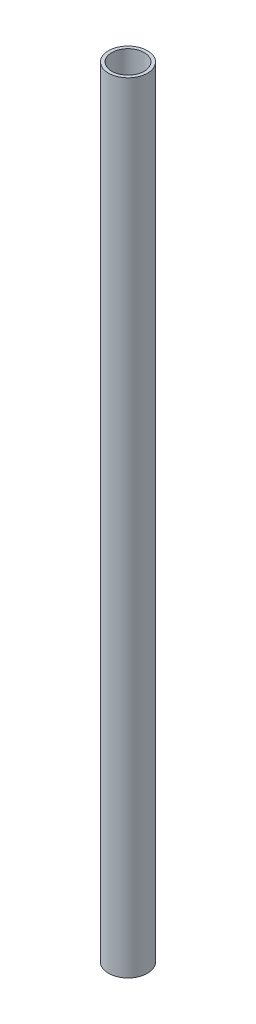
ISO-10303-21;
HEADER;
FILE_DESCRIPTION(('STEP AP214'),'2;1');
FILE_NAME('part.step','',(''),(''),'','','');
FILE_SCHEMA(('AUTOMOTIVE_DESIGN { 1 0 10303 214 1 1 1 1 }'));
ENDSEC;
DATA;
#1=APPLICATION_CONTEXT('core data for automotive mechanical design processes');
#2=APPLICATION_PROTOCOL_DEFINITION('international standard','automotive_design',2000,#1);
#3=PRODUCT_CONTEXT('',#1,'mechanical');
#4=PRODUCT('Part','Part','',(#3));
#5=PRODUCT_RELATED_PRODUCT_CATEGORY('part','',(#4));
#6=PRODUCT_DEFINITION_FORMATION('','',#4);
#7=PRODUCT_DEFINITION_CONTEXT('part definition',#1,'design');
#8=PRODUCT_DEFINITION('design','',#6,#7);
#9=PRODUCT_DEFINITION_SHAPE('','',#8);
#10=(LENGTH_UNIT() NAMED_UNIT(*) SI_UNIT(.MILLI.,.METRE.));
#11=(NAMED_UNIT(*) PLANE_ANGLE_UNIT() SI_UNIT($,.RADIAN.));
#12=(NAMED_UNIT(*) SI_UNIT($,.STERADIAN.) SOLID_ANGLE_UNIT());
#13=UNCERTAINTY_MEASURE_WITH_UNIT(LENGTH_MEASURE(1.E-05),#10,'distance_accuracy_value','');
#14=(GEOMETRIC_REPRESENTATION_CONTEXT(3) GLOBAL_UNCERTAINTY_ASSIGNED_CONTEXT((#13)) GLOBAL_UNIT_ASSIGNED_CONTEXT((#10,
#11,#12)) REPRESENTATION_CONTEXT('',''));
#15=CARTESIAN_POINT('',(0.,0.,0.));
#16=DIRECTION('',(0.,0.,1.));
#17=DIRECTION('',(1.,0.,0.));
#18=AXIS2_PLACEMENT_3D('',#15,#16,#17);
#19=CARTESIAN_POINT('',(0.,609.6,0.));
#20=DIRECTION('',(0.,1.,0.));
#21=DIRECTION('',(0.,0.,1.));
#22=AXIS2_PLACEMENT_3D('',#19,#20,#21);
#23=PLANE('',#22);
#24=CARTESIAN_POINT('',(0.,609.6,0.));
#25=DIRECTION('',(0.,1.,0.));
#26=DIRECTION('',(0.,0.,1.));
#27=AXIS2_PLACEMENT_3D('',#24,#25,#26);
#28=CIRCLE('',#27,30.48);
#29=CARTESIAN_POINT('',(0.,609.6,30.48));
#30=VERTEX_POINT('',#29);
#31=EDGE_CURVE('E10',#30,#30,#28,.T.);
#32=ORIENTED_EDGE('',*,*,#31,.T.);
#33=EDGE_LOOP('',(#32));
#34=FACE_BOUND('',#33,.T.);
#35=CARTESIAN_POINT('',(0.,609.6,0.));
#36=DIRECTION('',(0.,1.,0.));
#37=DIRECTION('',(0.,0.,1.));
#38=AXIS2_PLACEMENT_3D('',#35,#36,#37);
#39=CIRCLE('',#38,25.4);
#40=CARTESIAN_POINT('',(0.,609.6,25.4));
#41=VERTEX_POINT('',#40);
#42=EDGE_CURVE('E41',#41,#41,#39,.T.);
#43=ORIENTED_EDGE('',*,*,#42,.F.);
#44=EDGE_LOOP('',(#43));
#45=FACE_BOUND('',#44,.T.);
#46=ADVANCED_FACE('F30',(#34,#45),#23,.T.);
#47=CARTESIAN_POINT('',(0.,-609.6,0.));
#48=DIRECTION('',(0.,1.,0.));
#49=DIRECTION('',(0.,0.,1.));
#50=AXIS2_PLACEMENT_3D('',#47,#48,#49);
#51=PLANE('',#50);
#52=CARTESIAN_POINT('',(0.,-609.6,0.));
#53=DIRECTION('',(0.,1.,0.));
#54=DIRECTION('',(0.,0.,1.));
#55=AXIS2_PLACEMENT_3D('',#52,#53,#54);
#56=CIRCLE('',#55,30.48);
#57=CARTESIAN_POINT('',(0.,-609.6,30.48));
#58=VERTEX_POINT('',#57);
#59=EDGE_CURVE('E34',#58,#58,#56,.T.);
#60=ORIENTED_EDGE('',*,*,#59,.F.);
#61=EDGE_LOOP('',(#60));
#62=FACE_BOUND('',#61,.T.);
#63=CARTESIAN_POINT('',(0.,-609.6,0.));
#64=DIRECTION('',(0.,1.,0.));
#65=DIRECTION('',(0.,0.,1.));
#66=AXIS2_PLACEMENT_3D('',#63,#64,#65);
#67=CIRCLE('',#66,25.4);
#68=CARTESIAN_POINT('',(0.,-609.6,25.4));
#69=VERTEX_POINT('',#68);
#70=EDGE_CURVE('E43',#69,#69,#67,.T.);
#71=ORIENTED_EDGE('',*,*,#70,.T.);
#72=EDGE_LOOP('',(#71));
#73=FACE_BOUND('',#72,.T.);
#74=ADVANCED_FACE('F53',(#62,#73),#51,.F.);
#75=CARTESIAN_POINT('',(0.,609.6,0.));
#76=DIRECTION('',(0.,-1.,0.));
#77=DIRECTION('',(0.,0.,-1.));
#78=AXIS2_PLACEMENT_3D('',#75,#76,#77);
#79=CYLINDRICAL_SURFACE('',#78,30.48);
#80=ORIENTED_EDGE('',*,*,#31,.F.);
#81=EDGE_LOOP('',(#80));
#82=FACE_BOUND('',#81,.T.);
#83=ORIENTED_EDGE('',*,*,#59,.T.);
#84=EDGE_LOOP('',(#83));
#85=FACE_BOUND('',#84,.T.);
#86=ADVANCED_FACE('F32',(#82,#85),#79,.T.);
#87=CARTESIAN_POINT('',(0.,609.6,0.));
#88=DIRECTION('',(0.,-1.,0.));
#89=DIRECTION('',(0.,0.,-1.));
#90=AXIS2_PLACEMENT_3D('',#87,#88,#89);
#91=CYLINDRICAL_SURFACE('',#90,25.4);
#92=ORIENTED_EDGE('',*,*,#42,.T.);
#93=EDGE_LOOP('',(#92));
#94=FACE_BOUND('',#93,.T.);
#95=ORIENTED_EDGE('',*,*,#70,.F.);
#96=EDGE_LOOP('',(#95));
#97=FACE_BOUND('',#96,.T.);
#98=ADVANCED_FACE('F49',(#94,#97),#91,.F.);
#99=CLOSED_SHELL('',(#46,#74,#86,#98));
#100=MANIFOLD_SOLID_BREP('B2',#99);
#101=ADVANCED_BREP_SHAPE_REPRESENTATION('',(#18,#100),#14);
#102=SHAPE_DEFINITION_REPRESENTATION(#9,#101);
ENDSEC;
END-ISO-10303-21;
